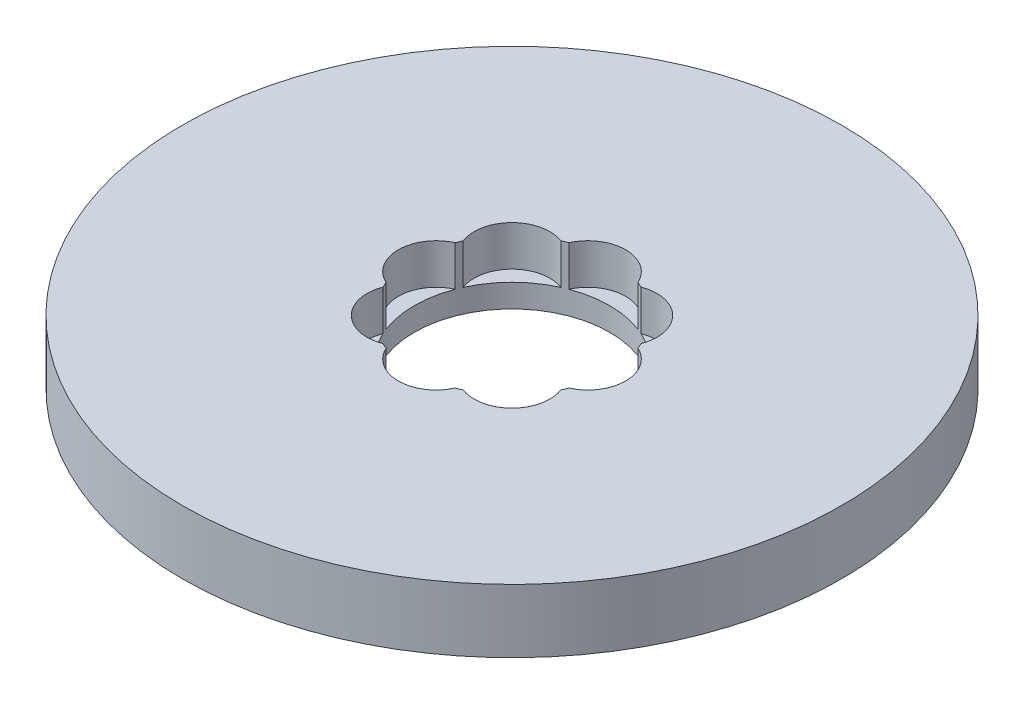
ISO-10303-21;
HEADER;
FILE_DESCRIPTION(('STEP AP214'),'2;1');
FILE_NAME('part.step','',(''),(''),'','','');
FILE_SCHEMA(('AUTOMOTIVE_DESIGN { 1 0 10303 214 1 1 1 1 }'));
ENDSEC;
DATA;
#1=APPLICATION_CONTEXT('core data for automotive mechanical design processes');
#2=APPLICATION_PROTOCOL_DEFINITION('international standard','automotive_design',2000,#1);
#3=PRODUCT_CONTEXT('',#1,'mechanical');
#4=PRODUCT('Part','Part','',(#3));
#5=PRODUCT_RELATED_PRODUCT_CATEGORY('part','',(#4));
#6=PRODUCT_DEFINITION_FORMATION('','',#4);
#7=PRODUCT_DEFINITION_CONTEXT('part definition',#1,'design');
#8=PRODUCT_DEFINITION('design','',#6,#7);
#9=PRODUCT_DEFINITION_SHAPE('','',#8);
#10=(LENGTH_UNIT() NAMED_UNIT(*) SI_UNIT(.MILLI.,.METRE.));
#11=(NAMED_UNIT(*) PLANE_ANGLE_UNIT() SI_UNIT($,.RADIAN.));
#12=(NAMED_UNIT(*) SI_UNIT($,.STERADIAN.) SOLID_ANGLE_UNIT());
#13=UNCERTAINTY_MEASURE_WITH_UNIT(LENGTH_MEASURE(1.E-05),#10,'distance_accuracy_value','');
#14=(GEOMETRIC_REPRESENTATION_CONTEXT(3) GLOBAL_UNCERTAINTY_ASSIGNED_CONTEXT((#13)) GLOBAL_UNIT_ASSIGNED_CONTEXT((#10,
#11,#12)) REPRESENTATION_CONTEXT('',''));
#15=CARTESIAN_POINT('',(0.,0.,0.));
#16=DIRECTION('',(0.,0.,1.));
#17=DIRECTION('',(1.,0.,0.));
#18=AXIS2_PLACEMENT_3D('',#15,#16,#17);
#19=CARTESIAN_POINT('',(0.,13.,0.));
#20=DIRECTION('',(0.,-1.,0.));
#21=DIRECTION('',(0.,0.,-1.));
#22=AXIS2_PLACEMENT_3D('',#19,#20,#21);
#23=CYLINDRICAL_SURFACE('',#22,67.5);
#24=CARTESIAN_POINT('',(0.,13.,0.));
#25=DIRECTION('',(0.,1.,0.));
#26=DIRECTION('',(0.,0.,1.));
#27=AXIS2_PLACEMENT_3D('',#24,#25,#26);
#28=CIRCLE('',#27,67.5);
#29=CARTESIAN_POINT('',(0.,13.,-67.5));
#30=VERTEX_POINT('',#29);
#31=EDGE_CURVE('E263',#30,#30,#28,.T.);
#32=CARTESIAN_POINT('',(0.,0.,0.));
#33=DIRECTION('',(0.,1.,0.));
#34=DIRECTION('',(0.,0.,1.));
#35=AXIS2_PLACEMENT_3D('',#32,#33,#34);
#36=CIRCLE('',#35,67.5);
#37=CARTESIAN_POINT('',(0.,0.,-67.5));
#38=VERTEX_POINT('',#37);
#39=EDGE_CURVE('E256',#38,#38,#36,.T.);
#40=CARTESIAN_POINT('',(0.,13.,-67.5));
#41=CARTESIAN_POINT('',(0.,12.8645833333333,-67.5));
#42=CARTESIAN_POINT('',(0.,12.7291666666667,-67.5));
#43=CARTESIAN_POINT('',(0.,12.4583333333333,-67.5));
#44=CARTESIAN_POINT('',(0.,12.3229166666667,-67.5));
#45=CARTESIAN_POINT('',(0.,12.0520833333333,-67.5));
#46=CARTESIAN_POINT('',(0.,11.9166666666667,-67.5));
#47=CARTESIAN_POINT('',(0.,11.6458333333333,-67.5));
#48=CARTESIAN_POINT('',(0.,11.5104166666667,-67.5));
#49=CARTESIAN_POINT('',(0.,11.2395833333333,-67.5));
#50=CARTESIAN_POINT('',(0.,11.1041666666667,-67.5));
#51=CARTESIAN_POINT('',(0.,10.8333333333333,-67.5));
#52=CARTESIAN_POINT('',(0.,10.6979166666667,-67.5));
#53=CARTESIAN_POINT('',(0.,10.4270833333333,-67.5));
#54=CARTESIAN_POINT('',(0.,10.2916666666667,-67.5));
#55=CARTESIAN_POINT('',(0.,10.0208333333333,-67.5));
#56=CARTESIAN_POINT('',(0.,9.88541666666667,-67.5));
#57=CARTESIAN_POINT('',(0.,9.61458333333333,-67.5));
#58=CARTESIAN_POINT('',(0.,9.47916666666667,-67.5));
#59=CARTESIAN_POINT('',(0.,9.20833333333333,-67.5));
#60=CARTESIAN_POINT('',(0.,9.07291666666667,-67.5));
#61=CARTESIAN_POINT('',(0.,8.80208333333333,-67.5));
#62=CARTESIAN_POINT('',(0.,8.66666666666667,-67.5));
#63=CARTESIAN_POINT('',(0.,8.39583333333333,-67.5));
#64=CARTESIAN_POINT('',(0.,8.26041666666667,-67.5));
#65=CARTESIAN_POINT('',(0.,7.98958333333333,-67.5));
#66=CARTESIAN_POINT('',(0.,7.85416666666667,-67.5));
#67=CARTESIAN_POINT('',(0.,7.58333333333333,-67.5));
#68=CARTESIAN_POINT('',(0.,7.44791666666667,-67.5));
#69=CARTESIAN_POINT('',(0.,7.17708333333333,-67.5));
#70=CARTESIAN_POINT('',(0.,7.04166666666667,-67.5));
#71=CARTESIAN_POINT('',(0.,6.77083333333333,-67.5));
#72=CARTESIAN_POINT('',(0.,6.63541666666667,-67.5));
#73=CARTESIAN_POINT('',(0.,6.36458333333333,-67.5));
#74=CARTESIAN_POINT('',(0.,6.22916666666667,-67.5));
#75=CARTESIAN_POINT('',(0.,5.95833333333333,-67.5));
#76=CARTESIAN_POINT('',(0.,5.82291666666667,-67.5));
#77=CARTESIAN_POINT('',(0.,5.55208333333333,-67.5));
#78=CARTESIAN_POINT('',(0.,5.41666666666667,-67.5));
#79=CARTESIAN_POINT('',(0.,5.14583333333333,-67.5));
#80=CARTESIAN_POINT('',(0.,5.01041666666667,-67.5));
#81=CARTESIAN_POINT('',(0.,4.73958333333333,-67.5));
#82=CARTESIAN_POINT('',(0.,4.60416666666667,-67.5));
#83=CARTESIAN_POINT('',(0.,4.33333333333333,-67.5));
#84=CARTESIAN_POINT('',(0.,4.19791666666667,-67.5));
#85=CARTESIAN_POINT('',(0.,3.92708333333333,-67.5));
#86=CARTESIAN_POINT('',(0.,3.79166666666667,-67.5));
#87=CARTESIAN_POINT('',(0.,3.52083333333333,-67.5));
#88=CARTESIAN_POINT('',(0.,3.38541666666667,-67.5));
#89=CARTESIAN_POINT('',(0.,3.11458333333333,-67.5));
#90=CARTESIAN_POINT('',(0.,2.97916666666667,-67.5));
#91=CARTESIAN_POINT('',(0.,2.70833333333333,-67.5));
#92=CARTESIAN_POINT('',(0.,2.57291666666667,-67.5));
#93=CARTESIAN_POINT('',(0.,2.30208333333333,-67.5));
#94=CARTESIAN_POINT('',(0.,2.16666666666667,-67.5));
#95=CARTESIAN_POINT('',(0.,1.89583333333333,-67.5));
#96=CARTESIAN_POINT('',(0.,1.76041666666667,-67.5));
#97=CARTESIAN_POINT('',(0.,1.48958333333333,-67.5));
#98=CARTESIAN_POINT('',(0.,1.35416666666667,-67.5));
#99=CARTESIAN_POINT('',(0.,1.08333333333333,-67.5));
#100=CARTESIAN_POINT('',(0.,0.947916666666667,-67.5));
#101=CARTESIAN_POINT('',(0.,0.677083333333334,-67.5));
#102=CARTESIAN_POINT('',(0.,0.541666666666667,-67.5));
#103=CARTESIAN_POINT('',(0.,0.270833333333334,-67.5));
#104=CARTESIAN_POINT('',(0.,0.135416666666667,-67.5));
#105=CARTESIAN_POINT('',(0.,0.,-67.5));
#106=B_SPLINE_CURVE_WITH_KNOTS('',3,(#40,#41,#42,#43,#44,#45,#46,#47,#48,#49,#50,#51,#52,#53,
#54,#55,#56,#57,#58,#59,#60,#61,#62,#63,#64,#65,#66,#67,#68,#69,#70,#71,#72,#73,#74,#75,#76,#77,
#78,#79,#80,#81,#82,#83,#84,#85,#86,#87,#88,#89,#90,#91,#92,#93,#94,#95,#96,#97,#98,#99,#100,
#101,#102,#103,#104,#105),.UNSPECIFIED.,.F.,.F.,(4,2,2,2,2,2,2,2,2,2,2,2,2,2,2,2,2,2,2,2,2,2,2,
2,2,2,2,2,2,2,2,2,4),(0.,0.406249999999999,0.812499999999999,1.21875,1.625,2.03125,2.4375,
2.84375,3.25,3.65625,4.0625,4.46875,4.875,5.28125,5.6875,6.09375,6.5,6.90625,7.3125,7.71875,
8.125,8.53125,8.9375,9.34375,9.75,10.15625,10.5625,10.96875,11.375,11.78125,12.1875,12.59375,
13.),.UNSPECIFIED.);
#107=EDGE_CURVE('BSEAM39',#30,#38,#106,.T.);
#108=ORIENTED_EDGE('',*,*,#31,.F.);
#109=ORIENTED_EDGE('',*,*,#39,.T.);
#110=ORIENTED_EDGE('',*,*,#107,.T.);
#111=ORIENTED_EDGE('',*,*,#107,.F.);
#112=EDGE_LOOP('',(#108,#110,#109,#111));
#113=FACE_BOUND('',#112,.T.);
#114=ADVANCED_FACE('F39',(#113),#23,.T.);
#115=CARTESIAN_POINT('',(0.,13.,0.));
#116=DIRECTION('',(0.,1.,0.));
#117=DIRECTION('',(0.,0.,1.));
#118=AXIS2_PLACEMENT_3D('',#115,#116,#117);
#119=PLANE('',#118);
#120=CARTESIAN_POINT('',(-10.9761946696279,13.,10.9761946696279));
#121=DIRECTION('',(0.,1.,0.));
#122=DIRECTION('',(0.707106781186549,0.,0.707106781186546));
#123=AXIS2_PLACEMENT_3D('',#120,#121,#122);
#124=CIRCLE('',#123,7.75855958216514);
#125=CARTESIAN_POINT('',(-18.2305240297192,13.,8.22484003502994));
#126=VERTEX_POINT('',#125);
#127=CARTESIAN_POINT('',(-8.22484003502988,13.,18.2305240297192));
#128=VERTEX_POINT('',#127);
#129=EDGE_CURVE('E246',#126,#128,#124,.T.);
#130=ORIENTED_EDGE('',*,*,#129,.F.);
#131=CARTESIAN_POINT('',(0.,13.,0.));
#132=DIRECTION('',(0.,1.,0.));
#133=DIRECTION('',(0.,0.,1.));
#134=AXIS2_PLACEMENT_3D('',#131,#132,#133);
#135=CIRCLE('',#134,20.);
#136=CARTESIAN_POINT('',(-18.706767328943,13.,7.0750870030545));
#137=VERTEX_POINT('',#136);
#138=EDGE_CURVE('E254',#137,#126,#135,.T.);
#139=ORIENTED_EDGE('',*,*,#138,.F.);
#140=CARTESIAN_POINT('',(-15.5226833650351,13.,0.));
#141=DIRECTION('',(0.,1.,0.));
#142=DIRECTION('',(0.,0.,1.));
#143=AXIS2_PLACEMENT_3D('',#140,#141,#142);
#144=CIRCLE('',#143,7.75855958216514);
#145=CARTESIAN_POINT('',(-18.706767328943,13.,-7.0750870030545));
#146=VERTEX_POINT('',#145);
#147=EDGE_CURVE('E248',#146,#137,#144,.T.);
#148=ORIENTED_EDGE('',*,*,#147,.F.);
#149=CARTESIAN_POINT('',(-18.2305240297193,13.,-8.22484003502969));
#150=VERTEX_POINT('',#149);
#151=EDGE_CURVE('E257',#150,#146,#135,.T.);
#152=ORIENTED_EDGE('',*,*,#151,.F.);
#153=CARTESIAN_POINT('',(-10.976194669628,13.,-10.9761946696278));
#154=DIRECTION('',(0.,1.,0.));
#155=DIRECTION('',(-0.707106781186539,0.,0.707106781186556));
#156=AXIS2_PLACEMENT_3D('',#153,#154,#155);
#157=CIRCLE('',#156,7.75855958216514);
#158=CARTESIAN_POINT('',(-8.22484003503013,13.,-18.2305240297191));
#159=VERTEX_POINT('',#158);
#160=EDGE_CURVE('E58',#159,#150,#157,.T.);
#161=ORIENTED_EDGE('',*,*,#160,.F.);
#162=CARTESIAN_POINT('',(-7.0750870030547,13.,-18.7067673289429));
#163=VERTEX_POINT('',#162);
#164=EDGE_CURVE('E168',#163,#159,#135,.T.);
#165=ORIENTED_EDGE('',*,*,#164,.F.);
#166=CARTESIAN_POINT('',(-1.62591477893372E-13,13.,-15.5226833650351));
#167=DIRECTION('',(0.,1.,0.));
#168=DIRECTION('',(-1.,0.,0.));
#169=AXIS2_PLACEMENT_3D('',#166,#167,#168);
#170=CIRCLE('',#169,7.75855958216514);
#171=CARTESIAN_POINT('',(7.07508700305431,13.,-18.7067673289431));
#172=VERTEX_POINT('',#171);
#173=EDGE_CURVE('E165',#172,#163,#170,.T.);
#174=ORIENTED_EDGE('',*,*,#173,.F.);
#175=CARTESIAN_POINT('',(8.22484003502975,13.,-18.2305240297193));
#176=VERTEX_POINT('',#175);
#177=EDGE_CURVE('E604',#176,#172,#135,.T.);
#178=ORIENTED_EDGE('',*,*,#177,.F.);
#179=CARTESIAN_POINT('',(10.9761946696278,13.,-10.976194669628));
#180=DIRECTION('',(0.,1.,0.));
#181=DIRECTION('',(-0.707106781186554,0.,-0.707106781186541));
#182=AXIS2_PLACEMENT_3D('',#179,#180,#181);
#183=CIRCLE('',#182,7.75855958216514);
#184=CARTESIAN_POINT('',(18.2305240297191,13.,-8.22484003503006));
#185=VERTEX_POINT('',#184);
#186=EDGE_CURVE('E224',#185,#176,#183,.T.);
#187=ORIENTED_EDGE('',*,*,#186,.F.);
#188=CARTESIAN_POINT('',(18.706767328943,13.,-7.0750870030545));
#189=VERTEX_POINT('',#188);
#190=EDGE_CURVE('E605',#189,#185,#135,.T.);
#191=ORIENTED_EDGE('',*,*,#190,.F.);
#192=CARTESIAN_POINT('',(15.5226833650351,13.,0.));
#193=DIRECTION('',(0.,1.,0.));
#194=DIRECTION('',(0.,0.,-1.));
#195=AXIS2_PLACEMENT_3D('',#192,#193,#194);
#196=CIRCLE('',#195,7.75855958216514);
#197=CARTESIAN_POINT('',(18.706767328943,13.,7.0750870030545));
#198=VERTEX_POINT('',#197);
#199=EDGE_CURVE('E231',#198,#189,#196,.T.);
#200=ORIENTED_EDGE('',*,*,#199,.F.);
#201=CARTESIAN_POINT('',(18.2305240297192,13.,8.22484003502981));
#202=VERTEX_POINT('',#201);
#203=EDGE_CURVE('E599',#202,#198,#135,.T.);
#204=ORIENTED_EDGE('',*,*,#203,.F.);
#205=CARTESIAN_POINT('',(10.976194669628,13.,10.9761946696278));
#206=DIRECTION('',(0.,1.,0.));
#207=DIRECTION('',(0.707106781186544,0.,-0.707106781186551));
#208=AXIS2_PLACEMENT_3D('',#205,#206,#207);
#209=CIRCLE('',#208,7.75855958216514);
#210=CARTESIAN_POINT('',(8.22484003503,13.,18.2305240297192));
#211=VERTEX_POINT('',#210);
#212=EDGE_CURVE('E237',#211,#202,#209,.T.);
#213=ORIENTED_EDGE('',*,*,#212,.F.);
#214=CARTESIAN_POINT('',(7.07508700305457,13.,18.706767328943));
#215=VERTEX_POINT('',#214);
#216=EDGE_CURVE('E598',#215,#211,#135,.T.);
#217=ORIENTED_EDGE('',*,*,#216,.F.);
#218=CARTESIAN_POINT('',(0.,13.,15.5226833650351));
#219=DIRECTION('',(0.,1.,0.));
#220=DIRECTION('',(1.,0.,0.));
#221=AXIS2_PLACEMENT_3D('',#218,#219,#220);
#222=CIRCLE('',#221,7.75855958216514);
#223=CARTESIAN_POINT('',(-7.07508700305444,13.,18.706767328943));
#224=VERTEX_POINT('',#223);
#225=EDGE_CURVE('E241',#224,#215,#222,.T.);
#226=ORIENTED_EDGE('',*,*,#225,.F.);
#227=EDGE_CURVE('E259',#128,#224,#135,.T.);
#228=ORIENTED_EDGE('',*,*,#227,.F.);
#229=EDGE_LOOP('',(#130,#139,#148,#152,#161,#165,#174,#178,#187,#191,#200,#204,#213,#217,#226,#228));
#230=FACE_BOUND('',#229,.T.);
#231=ORIENTED_EDGE('',*,*,#31,.T.);
#232=EDGE_LOOP('',(#231));
#233=FACE_BOUND('',#232,.T.);
#234=ADVANCED_FACE('F286',(#230,#233),#119,.T.);
#235=CARTESIAN_POINT('',(0.,0.,0.));
#236=DIRECTION('',(0.,1.,0.));
#237=DIRECTION('',(0.,0.,1.));
#238=AXIS2_PLACEMENT_3D('',#235,#236,#237);
#239=PLANE('',#238);
#240=CARTESIAN_POINT('',(0.,0.,0.));
#241=DIRECTION('',(0.,1.,0.));
#242=DIRECTION('',(0.,0.,1.));
#243=AXIS2_PLACEMENT_3D('',#240,#241,#242);
#244=CIRCLE('',#243,20.);
#245=CARTESIAN_POINT('',(0.,0.,20.));
#246=VERTEX_POINT('',#245);
#247=EDGE_CURVE('E251',#246,#246,#244,.T.);
#248=ORIENTED_EDGE('',*,*,#247,.T.);
#249=EDGE_LOOP('',(#248));
#250=FACE_BOUND('',#249,.T.);
#251=ORIENTED_EDGE('',*,*,#39,.F.);
#252=EDGE_LOOP('',(#251));
#253=FACE_BOUND('',#252,.T.);
#254=ADVANCED_FACE('F308',(#250,#253),#239,.F.);
#255=CARTESIAN_POINT('',(0.,13.,0.));
#256=DIRECTION('',(0.,-1.,0.));
#257=DIRECTION('',(0.,0.,-1.));
#258=AXIS2_PLACEMENT_3D('',#255,#256,#257);
#259=CYLINDRICAL_SURFACE('',#258,20.);
#260=DIRECTION('',(0.,1.,0.));
#261=VECTOR('',#260,1.);
#262=CARTESIAN_POINT('',(-18.2305240297192,8.86820345487541,8.22484003502994));
#263=LINE('',#262,#261);
#264=CARTESIAN_POINT('',(-18.2305240297192,4.73640690975082,8.22484003502994));
#265=VERTEX_POINT('',#264);
#266=EDGE_CURVE('E11',#265,#126,#263,.T.);
#267=ORIENTED_EDGE('',*,*,#266,.F.);
#268=CARTESIAN_POINT('',(0.,4.73640690975082,0.));
#269=DIRECTION('',(0.,1.,0.));
#270=DIRECTION('',(0.,0.,1.));
#271=AXIS2_PLACEMENT_3D('',#268,#269,#270);
#272=CIRCLE('',#271,20.);
#273=CARTESIAN_POINT('',(-8.22484003502988,4.73640690975082,18.2305240297192));
#274=VERTEX_POINT('',#273);
#275=EDGE_CURVE('E157',#265,#274,#272,.T.);
#276=ORIENTED_EDGE('',*,*,#275,.T.);
#277=DIRECTION('',(0.,1.,0.));
#278=VECTOR('',#277,1.);
#279=CARTESIAN_POINT('',(-8.22484003502988,8.86820345487541,18.2305240297192));
#280=LINE('',#279,#278);
#281=EDGE_CURVE('E46',#128,#274,#280,.F.);
#282=ORIENTED_EDGE('',*,*,#281,.F.);
#283=ORIENTED_EDGE('',*,*,#227,.T.);
#284=DIRECTION('',(0.,1.,0.));
#285=VECTOR('',#284,1.);
#286=CARTESIAN_POINT('',(-7.07508700305444,8.86820345487541,18.706767328943));
#287=LINE('',#286,#285);
#288=CARTESIAN_POINT('',(-7.07508700305444,4.73640690975082,18.706767328943));
#289=VERTEX_POINT('',#288);
#290=EDGE_CURVE('E198',#289,#224,#287,.T.);
#291=ORIENTED_EDGE('',*,*,#290,.F.);
#292=CARTESIAN_POINT('',(7.07508700305457,4.73640690975082,18.706767328943));
#293=VERTEX_POINT('',#292);
#294=EDGE_CURVE('E194',#289,#293,#272,.T.);
#295=ORIENTED_EDGE('',*,*,#294,.T.);
#296=DIRECTION('',(0.,1.,0.));
#297=VECTOR('',#296,1.);
#298=CARTESIAN_POINT('',(7.07508700305457,8.86820345487541,18.706767328943));
#299=LINE('',#298,#297);
#300=EDGE_CURVE('E192',#215,#293,#299,.F.);
#301=ORIENTED_EDGE('',*,*,#300,.F.);
#302=ORIENTED_EDGE('',*,*,#216,.T.);
#303=DIRECTION('',(0.,1.,0.));
#304=VECTOR('',#303,1.);
#305=CARTESIAN_POINT('',(8.22484003503,8.86820345487541,18.2305240297192));
#306=LINE('',#305,#304);
#307=CARTESIAN_POINT('',(8.22484003503,4.73640690975082,18.2305240297192));
#308=VERTEX_POINT('',#307);
#309=EDGE_CURVE('E191',#308,#211,#306,.T.);
#310=ORIENTED_EDGE('',*,*,#309,.F.);
#311=CARTESIAN_POINT('',(18.2305240297192,4.73640690975082,8.22484003502981));
#312=VERTEX_POINT('',#311);
#313=EDGE_CURVE('E189',#308,#312,#272,.T.);
#314=ORIENTED_EDGE('',*,*,#313,.T.);
#315=DIRECTION('',(0.,1.,0.));
#316=VECTOR('',#315,1.);
#317=CARTESIAN_POINT('',(18.2305240297192,8.86820345487541,8.22484003502981));
#318=LINE('',#317,#316);
#319=EDGE_CURVE('E187',#202,#312,#318,.F.);
#320=ORIENTED_EDGE('',*,*,#319,.F.);
#321=ORIENTED_EDGE('',*,*,#203,.T.);
#322=DIRECTION('',(0.,1.,0.));
#323=VECTOR('',#322,1.);
#324=CARTESIAN_POINT('',(18.706767328943,8.86820345487541,7.0750870030545));
#325=LINE('',#324,#323);
#326=CARTESIAN_POINT('',(18.706767328943,4.73640690975082,7.0750870030545));
#327=VERTEX_POINT('',#326);
#328=EDGE_CURVE('E186',#327,#198,#325,.T.);
#329=ORIENTED_EDGE('',*,*,#328,.F.);
#330=CARTESIAN_POINT('',(18.706767328943,4.73640690975082,-7.0750870030545));
#331=VERTEX_POINT('',#330);
#332=EDGE_CURVE('E183',#327,#331,#272,.T.);
#333=ORIENTED_EDGE('',*,*,#332,.T.);
#334=DIRECTION('',(0.,1.,0.));
#335=VECTOR('',#334,1.);
#336=CARTESIAN_POINT('',(18.706767328943,8.86820345487541,-7.0750870030545));
#337=LINE('',#336,#335);
#338=EDGE_CURVE('E181',#189,#331,#337,.F.);
#339=ORIENTED_EDGE('',*,*,#338,.F.);
#340=ORIENTED_EDGE('',*,*,#190,.T.);
#341=DIRECTION('',(0.,1.,0.));
#342=VECTOR('',#341,1.);
#343=CARTESIAN_POINT('',(18.2305240297191,8.86820345487541,-8.22484003503007));
#344=LINE('',#343,#342);
#345=CARTESIAN_POINT('',(18.2305240297191,4.73640690975082,-8.22484003503006));
#346=VERTEX_POINT('',#345);
#347=EDGE_CURVE('E182',#346,#185,#344,.T.);
#348=ORIENTED_EDGE('',*,*,#347,.F.);
#349=CARTESIAN_POINT('',(8.22484003502975,4.73640690975082,-18.2305240297193));
#350=VERTEX_POINT('',#349);
#351=EDGE_CURVE('E179',#346,#350,#272,.T.);
#352=ORIENTED_EDGE('',*,*,#351,.T.);
#353=DIRECTION('',(0.,1.,0.));
#354=VECTOR('',#353,1.);
#355=CARTESIAN_POINT('',(8.22484003502975,8.86820345487541,-18.2305240297193));
#356=LINE('',#355,#354);
#357=EDGE_CURVE('E177',#176,#350,#356,.F.);
#358=ORIENTED_EDGE('',*,*,#357,.F.);
#359=ORIENTED_EDGE('',*,*,#177,.T.);
#360=DIRECTION('',(0.,1.,0.));
#361=VECTOR('',#360,1.);
#362=CARTESIAN_POINT('',(7.07508700305431,8.86820345487541,-18.7067673289431));
#363=LINE('',#362,#361);
#364=CARTESIAN_POINT('',(7.07508700305431,4.73640690975082,-18.7067673289431));
#365=VERTEX_POINT('',#364);
#366=EDGE_CURVE('E176',#365,#172,#363,.T.);
#367=ORIENTED_EDGE('',*,*,#366,.F.);
#368=CARTESIAN_POINT('',(-7.0750870030547,4.73640690975082,-18.7067673289429));
#369=VERTEX_POINT('',#368);
#370=EDGE_CURVE('E159',#365,#369,#272,.T.);
#371=ORIENTED_EDGE('',*,*,#370,.T.);
#372=DIRECTION('',(0.,1.,0.));
#373=VECTOR('',#372,1.);
#374=CARTESIAN_POINT('',(-7.0750870030547,8.86820345487541,-18.7067673289429));
#375=LINE('',#374,#373);
#376=EDGE_CURVE('E171',#163,#369,#375,.F.);
#377=ORIENTED_EDGE('',*,*,#376,.F.);
#378=ORIENTED_EDGE('',*,*,#164,.T.);
#379=DIRECTION('',(0.,1.,0.));
#380=VECTOR('',#379,1.);
#381=CARTESIAN_POINT('',(-8.22484003503013,8.86820345487541,-18.2305240297191));
#382=LINE('',#381,#380);
#383=CARTESIAN_POINT('',(-8.22484003503013,4.73640690975082,-18.2305240297191));
#384=VERTEX_POINT('',#383);
#385=EDGE_CURVE('E156',#384,#159,#382,.T.);
#386=ORIENTED_EDGE('',*,*,#385,.F.);
#387=CARTESIAN_POINT('',(-18.2305240297193,4.73640690975082,-8.22484003502969));
#388=VERTEX_POINT('',#387);
#389=EDGE_CURVE('E147',#384,#388,#272,.T.);
#390=ORIENTED_EDGE('',*,*,#389,.T.);
#391=DIRECTION('',(0.,1.,0.));
#392=VECTOR('',#391,1.);
#393=CARTESIAN_POINT('',(-18.2305240297193,8.86820345487541,-8.22484003502968));
#394=LINE('',#393,#392);
#395=EDGE_CURVE('E160',#150,#388,#394,.F.);
#396=ORIENTED_EDGE('',*,*,#395,.F.);
#397=ORIENTED_EDGE('',*,*,#151,.T.);
#398=DIRECTION('',(0.,1.,0.));
#399=VECTOR('',#398,1.);
#400=CARTESIAN_POINT('',(-18.706767328943,8.86820345487541,-7.0750870030545));
#401=LINE('',#400,#399);
#402=CARTESIAN_POINT('',(-18.706767328943,4.73640690975082,-7.0750870030545));
#403=VERTEX_POINT('',#402);
#404=EDGE_CURVE('E273',#403,#146,#401,.T.);
#405=ORIENTED_EDGE('',*,*,#404,.F.);
#406=CARTESIAN_POINT('',(0.,4.73640690975082,0.));
#407=DIRECTION('',(0.,1.,0.));
#408=DIRECTION('',(0.,0.,1.));
#409=AXIS2_PLACEMENT_3D('',#406,#407,#408);
#410=CIRCLE('',#409,20.);
#411=CARTESIAN_POINT('',(-18.706767328943,4.73640690975082,7.0750870030545));
#412=VERTEX_POINT('',#411);
#413=EDGE_CURVE('E266',#403,#412,#410,.T.);
#414=ORIENTED_EDGE('',*,*,#413,.T.);
#415=DIRECTION('',(0.,1.,0.));
#416=VECTOR('',#415,1.);
#417=CARTESIAN_POINT('',(-18.706767328943,8.86820345487541,7.0750870030545));
#418=LINE('',#417,#416);
#419=EDGE_CURVE('E271',#137,#412,#418,.F.);
#420=ORIENTED_EDGE('',*,*,#419,.F.);
#421=ORIENTED_EDGE('',*,*,#138,.T.);
#422=EDGE_LOOP('',(#267,#276,#282,#283,#291,#295,#301,#302,#310,#314,#320,#321,#329,#333,#339,
#340,#348,#352,#358,#359,#367,#371,#377,#378,#386,#390,#396,#397,#405,#414,#420,#421));
#423=FACE_BOUND('',#422,.T.);
#424=ORIENTED_EDGE('',*,*,#247,.F.);
#425=EDGE_LOOP('',(#424));
#426=FACE_BOUND('',#425,.T.);
#427=ADVANCED_FACE('F167',(#423,#426),#259,.F.);
#428=CARTESIAN_POINT('',(-15.5226833650351,4.73640690975082,0.));
#429=DIRECTION('',(0.,1.,0.));
#430=DIRECTION('',(0.,0.,1.));
#431=AXIS2_PLACEMENT_3D('',#428,#429,#430);
#432=CYLINDRICAL_SURFACE('',#431,7.75855958216514);
#433=ORIENTED_EDGE('',*,*,#404,.T.);
#434=ORIENTED_EDGE('',*,*,#147,.T.);
#435=ORIENTED_EDGE('',*,*,#419,.T.);
#436=CARTESIAN_POINT('',(-15.5226833650351,4.73640690975082,0.));
#437=DIRECTION('',(0.,1.,0.));
#438=DIRECTION('',(0.,0.,1.));
#439=AXIS2_PLACEMENT_3D('',#436,#437,#438);
#440=CIRCLE('',#439,7.75855958216514);
#441=EDGE_CURVE('E253',#403,#412,#440,.T.);
#442=ORIENTED_EDGE('',*,*,#441,.F.);
#443=EDGE_LOOP('',(#433,#434,#435,#442));
#444=FACE_BOUND('',#443,.T.);
#445=ADVANCED_FACE('F278',(#444),#432,.F.);
#446=CARTESIAN_POINT('',(-15.5226833650351,4.73640690975082,0.));
#447=DIRECTION('',(0.,1.,0.));
#448=DIRECTION('',(0.,0.,1.));
#449=AXIS2_PLACEMENT_3D('',#446,#447,#448);
#450=PLANE('',#449);
#451=ORIENTED_EDGE('',*,*,#441,.T.);
#452=ORIENTED_EDGE('',*,*,#413,.F.);
#453=EDGE_LOOP('',(#451,#452));
#454=FACE_BOUND('',#453,.T.);
#455=ADVANCED_FACE('F289',(#454),#450,.T.);
#456=CARTESIAN_POINT('',(-10.976194669628,4.73640690975082,-10.9761946696278));
#457=DIRECTION('',(0.,1.,0.));
#458=DIRECTION('',(0.,0.,1.));
#459=AXIS2_PLACEMENT_3D('',#456,#457,#458);
#460=CYLINDRICAL_SURFACE('',#459,7.75855958216514);
#461=ORIENTED_EDGE('',*,*,#385,.T.);
#462=ORIENTED_EDGE('',*,*,#160,.T.);
#463=ORIENTED_EDGE('',*,*,#395,.T.);
#464=CARTESIAN_POINT('',(-10.976194669628,4.73640690975082,-10.9761946696278));
#465=DIRECTION('',(0.,1.,0.));
#466=DIRECTION('',(-0.707106781186539,0.,0.707106781186556));
#467=AXIS2_PLACEMENT_3D('',#464,#465,#466);
#468=CIRCLE('',#467,7.75855958216514);
#469=EDGE_CURVE('E153',#384,#388,#468,.T.);
#470=ORIENTED_EDGE('',*,*,#469,.F.);
#471=EDGE_LOOP('',(#461,#462,#463,#470));
#472=FACE_BOUND('',#471,.T.);
#473=ADVANCED_FACE('F161',(#472),#460,.F.);
#474=CARTESIAN_POINT('',(-10.9761946696279,4.73640690975082,10.9761946696279));
#475=DIRECTION('',(0.,1.,0.));
#476=DIRECTION('',(0.707106781186549,0.,0.707106781186546));
#477=AXIS2_PLACEMENT_3D('',#474,#475,#476);
#478=PLANE('',#477);
#479=ORIENTED_EDGE('',*,*,#469,.T.);
#480=ORIENTED_EDGE('',*,*,#389,.F.);
#481=EDGE_LOOP('',(#479,#480));
#482=FACE_BOUND('',#481,.T.);
#483=ADVANCED_FACE('F155',(#482),#478,.T.);
#484=CARTESIAN_POINT('',(-1.62591477893372E-13,4.73640690975082,-15.5226833650351));
#485=DIRECTION('',(0.,1.,0.));
#486=DIRECTION('',(0.,0.,1.));
#487=AXIS2_PLACEMENT_3D('',#484,#485,#486);
#488=CYLINDRICAL_SURFACE('',#487,7.75855958216514);
#489=ORIENTED_EDGE('',*,*,#366,.T.);
#490=ORIENTED_EDGE('',*,*,#173,.T.);
#491=ORIENTED_EDGE('',*,*,#376,.T.);
#492=CARTESIAN_POINT('',(-1.62591477893372E-13,4.73640690975082,-15.5226833650351));
#493=DIRECTION('',(0.,1.,0.));
#494=DIRECTION('',(-1.,0.,0.));
#495=AXIS2_PLACEMENT_3D('',#492,#493,#494);
#496=CIRCLE('',#495,7.75855958216514);
#497=EDGE_CURVE('E218',#365,#369,#496,.T.);
#498=ORIENTED_EDGE('',*,*,#497,.F.);
#499=EDGE_LOOP('',(#489,#490,#491,#498));
#500=FACE_BOUND('',#499,.T.);
#501=ADVANCED_FACE('F222',(#500),#488,.F.);
#502=ORIENTED_EDGE('',*,*,#497,.T.);
#503=ORIENTED_EDGE('',*,*,#370,.F.);
#504=EDGE_LOOP('',(#502,#503));
#505=FACE_BOUND('',#504,.T.);
#506=ADVANCED_FACE('F217',(#505),#478,.T.);
#507=CARTESIAN_POINT('',(10.9761946696278,4.73640690975082,-10.976194669628));
#508=DIRECTION('',(0.,1.,0.));
#509=DIRECTION('',(0.,0.,1.));
#510=AXIS2_PLACEMENT_3D('',#507,#508,#509);
#511=CYLINDRICAL_SURFACE('',#510,7.75855958216514);
#512=ORIENTED_EDGE('',*,*,#347,.T.);
#513=ORIENTED_EDGE('',*,*,#186,.T.);
#514=ORIENTED_EDGE('',*,*,#357,.T.);
#515=CARTESIAN_POINT('',(10.9761946696278,4.73640690975082,-10.976194669628));
#516=DIRECTION('',(0.,1.,0.));
#517=DIRECTION('',(-0.707106781186554,0.,-0.707106781186541));
#518=AXIS2_PLACEMENT_3D('',#515,#516,#517);
#519=CIRCLE('',#518,7.75855958216514);
#520=EDGE_CURVE('E223',#346,#350,#519,.T.);
#521=ORIENTED_EDGE('',*,*,#520,.F.);
#522=EDGE_LOOP('',(#512,#513,#514,#521));
#523=FACE_BOUND('',#522,.T.);
#524=ADVANCED_FACE('F355',(#523),#511,.F.);
#525=ORIENTED_EDGE('',*,*,#520,.T.);
#526=ORIENTED_EDGE('',*,*,#351,.F.);
#527=EDGE_LOOP('',(#525,#526));
#528=FACE_BOUND('',#527,.T.);
#529=ADVANCED_FACE('F352',(#528),#478,.T.);
#530=CARTESIAN_POINT('',(15.5226833650351,4.73640690975082,0.));
#531=DIRECTION('',(0.,1.,0.));
#532=DIRECTION('',(0.,0.,1.));
#533=AXIS2_PLACEMENT_3D('',#530,#531,#532);
#534=CYLINDRICAL_SURFACE('',#533,7.75855958216514);
#535=ORIENTED_EDGE('',*,*,#328,.T.);
#536=ORIENTED_EDGE('',*,*,#199,.T.);
#537=ORIENTED_EDGE('',*,*,#338,.T.);
#538=CARTESIAN_POINT('',(15.5226833650351,4.73640690975082,0.));
#539=DIRECTION('',(0.,1.,0.));
#540=DIRECTION('',(0.,0.,-1.));
#541=AXIS2_PLACEMENT_3D('',#538,#539,#540);
#542=CIRCLE('',#541,7.75855958216514);
#543=EDGE_CURVE('E232',#327,#331,#542,.T.);
#544=ORIENTED_EDGE('',*,*,#543,.F.);
#545=EDGE_LOOP('',(#535,#536,#537,#544));
#546=FACE_BOUND('',#545,.T.);
#547=ADVANCED_FACE('F369',(#546),#534,.F.);
#548=ORIENTED_EDGE('',*,*,#543,.T.);
#549=ORIENTED_EDGE('',*,*,#332,.F.);
#550=EDGE_LOOP('',(#548,#549));
#551=FACE_BOUND('',#550,.T.);
#552=ADVANCED_FACE('F371',(#551),#478,.T.);
#553=CARTESIAN_POINT('',(10.976194669628,4.73640690975082,10.9761946696278));
#554=DIRECTION('',(0.,1.,0.));
#555=DIRECTION('',(0.,0.,1.));
#556=AXIS2_PLACEMENT_3D('',#553,#554,#555);
#557=CYLINDRICAL_SURFACE('',#556,7.75855958216514);
#558=ORIENTED_EDGE('',*,*,#309,.T.);
#559=ORIENTED_EDGE('',*,*,#212,.T.);
#560=ORIENTED_EDGE('',*,*,#319,.T.);
#561=CARTESIAN_POINT('',(10.976194669628,4.73640690975082,10.9761946696278));
#562=DIRECTION('',(0.,1.,0.));
#563=DIRECTION('',(0.707106781186544,0.,-0.707106781186551));
#564=AXIS2_PLACEMENT_3D('',#561,#562,#563);
#565=CIRCLE('',#564,7.75855958216514);
#566=EDGE_CURVE('E236',#308,#312,#565,.T.);
#567=ORIENTED_EDGE('',*,*,#566,.F.);
#568=EDGE_LOOP('',(#558,#559,#560,#567));
#569=FACE_BOUND('',#568,.T.);
#570=ADVANCED_FACE('F390',(#569),#557,.F.);
#571=ORIENTED_EDGE('',*,*,#566,.T.);
#572=ORIENTED_EDGE('',*,*,#313,.F.);
#573=EDGE_LOOP('',(#571,#572));
#574=FACE_BOUND('',#573,.T.);
#575=ADVANCED_FACE('F386',(#574),#478,.T.);
#576=CARTESIAN_POINT('',(0.,4.73640690975082,15.5226833650351));
#577=DIRECTION('',(0.,1.,0.));
#578=DIRECTION('',(0.,0.,1.));
#579=AXIS2_PLACEMENT_3D('',#576,#577,#578);
#580=CYLINDRICAL_SURFACE('',#579,7.75855958216514);
#581=ORIENTED_EDGE('',*,*,#290,.T.);
#582=ORIENTED_EDGE('',*,*,#225,.T.);
#583=ORIENTED_EDGE('',*,*,#300,.T.);
#584=CARTESIAN_POINT('',(0.,4.73640690975082,15.5226833650351));
#585=DIRECTION('',(0.,1.,0.));
#586=DIRECTION('',(1.,0.,0.));
#587=AXIS2_PLACEMENT_3D('',#584,#585,#586);
#588=CIRCLE('',#587,7.75855958216514);
#589=EDGE_CURVE('E242',#289,#293,#588,.T.);
#590=ORIENTED_EDGE('',*,*,#589,.F.);
#591=EDGE_LOOP('',(#581,#582,#583,#590));
#592=FACE_BOUND('',#591,.T.);
#593=ADVANCED_FACE('F403',(#592),#580,.F.);
#594=ORIENTED_EDGE('',*,*,#589,.T.);
#595=ORIENTED_EDGE('',*,*,#294,.F.);
#596=EDGE_LOOP('',(#594,#595));
#597=FACE_BOUND('',#596,.T.);
#598=ADVANCED_FACE('F410',(#597),#478,.T.);
#599=CARTESIAN_POINT('',(-10.9761946696279,4.73640690975082,10.9761946696279));
#600=DIRECTION('',(0.,1.,0.));
#601=DIRECTION('',(0.707106781186549,0.,0.707106781186546));
#602=AXIS2_PLACEMENT_3D('',#599,#600,#601);
#603=CIRCLE('',#602,7.75855958216514);
#604=EDGE_CURVE('E55',#265,#274,#603,.T.);
#605=ORIENTED_EDGE('',*,*,#604,.T.);
#606=ORIENTED_EDGE('',*,*,#275,.F.);
#607=EDGE_LOOP('',(#605,#606));
#608=FACE_BOUND('',#607,.T.);
#609=ADVANCED_FACE('F340',(#608),#478,.T.);
#610=CARTESIAN_POINT('',(-10.9761946696279,4.73640690975082,10.9761946696279));
#611=DIRECTION('',(0.,1.,0.));
#612=DIRECTION('',(0.,0.,1.));
#613=AXIS2_PLACEMENT_3D('',#610,#611,#612);
#614=CYLINDRICAL_SURFACE('',#613,7.75855958216514);
#615=ORIENTED_EDGE('',*,*,#266,.T.);
#616=ORIENTED_EDGE('',*,*,#129,.T.);
#617=ORIENTED_EDGE('',*,*,#281,.T.);
#618=ORIENTED_EDGE('',*,*,#604,.F.);
#619=EDGE_LOOP('',(#615,#616,#617,#618));
#620=FACE_BOUND('',#619,.T.);
#621=ADVANCED_FACE('F431',(#620),#614,.F.);
#622=CLOSED_SHELL('',(#114,#234,#254,#427,#445,#455,#473,#483,#501,#506,#524,#529,#547,#552,
#570,#575,#593,#598,#609,#621));
#623=MANIFOLD_SOLID_BREP('B2',#622);
#624=ADVANCED_BREP_SHAPE_REPRESENTATION('',(#18,#623),#14);
#625=SHAPE_DEFINITION_REPRESENTATION(#9,#624);
ENDSEC;
END-ISO-10303-21;
